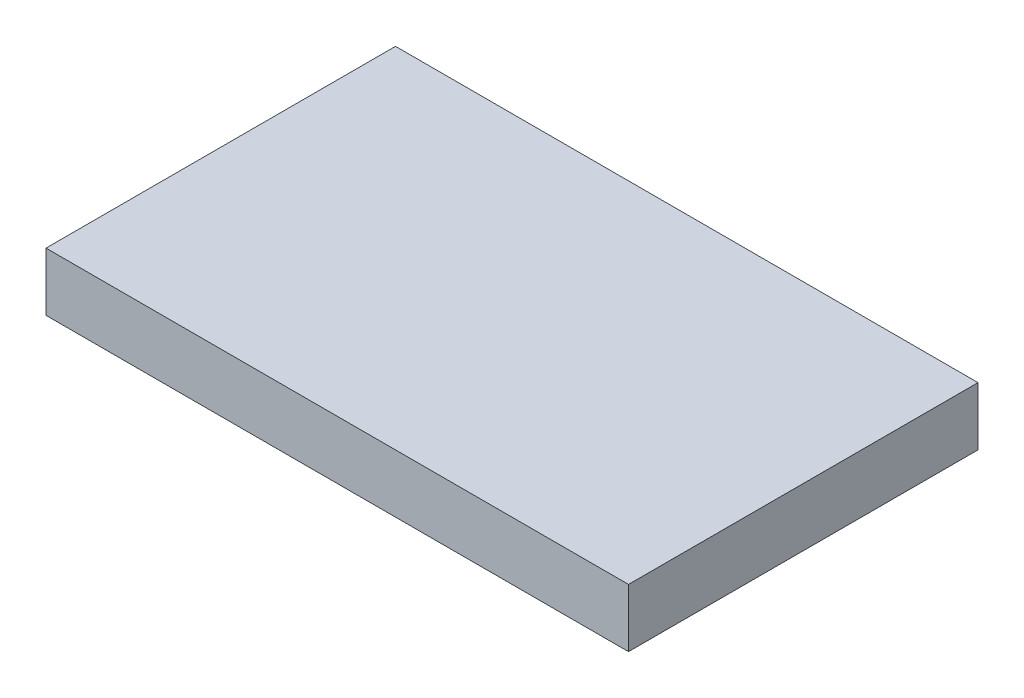
ISO-10303-21;
HEADER;
FILE_DESCRIPTION(('STEP AP214'),'2;1');
FILE_NAME('part.step','',(''),(''),'','','');
FILE_SCHEMA(('AUTOMOTIVE_DESIGN { 1 0 10303 214 1 1 1 1 }'));
ENDSEC;
DATA;
#1=APPLICATION_CONTEXT('core data for automotive mechanical design processes');
#2=APPLICATION_PROTOCOL_DEFINITION('international standard','automotive_design',2000,#1);
#3=PRODUCT_CONTEXT('',#1,'mechanical');
#4=PRODUCT('Part','Part','',(#3));
#5=PRODUCT_RELATED_PRODUCT_CATEGORY('part','',(#4));
#6=PRODUCT_DEFINITION_FORMATION('','',#4);
#7=PRODUCT_DEFINITION_CONTEXT('part definition',#1,'design');
#8=PRODUCT_DEFINITION('design','',#6,#7);
#9=PRODUCT_DEFINITION_SHAPE('','',#8);
#10=(LENGTH_UNIT() NAMED_UNIT(*) SI_UNIT(.MILLI.,.METRE.));
#11=(NAMED_UNIT(*) PLANE_ANGLE_UNIT() SI_UNIT($,.RADIAN.));
#12=(NAMED_UNIT(*) SI_UNIT($,.STERADIAN.) SOLID_ANGLE_UNIT());
#13=UNCERTAINTY_MEASURE_WITH_UNIT(LENGTH_MEASURE(1.E-05),#10,'distance_accuracy_value','');
#14=(GEOMETRIC_REPRESENTATION_CONTEXT(3) GLOBAL_UNCERTAINTY_ASSIGNED_CONTEXT((#13)) GLOBAL_UNIT_ASSIGNED_CONTEXT((#10,
#11,#12)) REPRESENTATION_CONTEXT('',''));
#15=CARTESIAN_POINT('',(0.,0.,0.));
#16=DIRECTION('',(0.,0.,1.));
#17=DIRECTION('',(1.,0.,0.));
#18=AXIS2_PLACEMENT_3D('',#15,#16,#17);
#19=CARTESIAN_POINT('',(0.,4.7625,0.));
#20=DIRECTION('',(1.,0.,0.));
#21=DIRECTION('',(0.,0.,-1.));
#22=AXIS2_PLACEMENT_3D('',#19,#20,#21);
#23=PLANE('',#22);
#24=DIRECTION('',(0.,0.,1.));
#25=VECTOR('',#24,1.);
#26=CARTESIAN_POINT('',(0.,0.,0.));
#27=LINE('',#26,#25);
#28=CARTESIAN_POINT('',(0.,0.,0.));
#29=VERTEX_POINT('',#28);
#30=CARTESIAN_POINT('',(0.,0.,28.575));
#31=VERTEX_POINT('',#30);
#32=EDGE_CURVE('E106',#29,#31,#27,.T.);
#33=ORIENTED_EDGE('',*,*,#32,.T.);
#34=DIRECTION('',(0.,-1.,0.));
#35=VECTOR('',#34,1.);
#36=CARTESIAN_POINT('',(0.,4.7625,28.575));
#37=LINE('',#36,#35);
#38=CARTESIAN_POINT('',(0.,4.7625,28.575));
#39=VERTEX_POINT('',#38);
#40=EDGE_CURVE('E11',#39,#31,#37,.T.);
#41=ORIENTED_EDGE('',*,*,#40,.F.);
#42=DIRECTION('',(0.,0.,1.));
#43=VECTOR('',#42,1.);
#44=CARTESIAN_POINT('',(0.,4.7625,0.));
#45=LINE('',#44,#43);
#46=CARTESIAN_POINT('',(0.,4.7625,0.));
#47=VERTEX_POINT('',#46);
#48=EDGE_CURVE('E94',#47,#39,#45,.T.);
#49=ORIENTED_EDGE('',*,*,#48,.F.);
#50=DIRECTION('',(0.,-1.,0.));
#51=VECTOR('',#50,1.);
#52=CARTESIAN_POINT('',(0.,4.7625,0.));
#53=LINE('',#52,#51);
#54=EDGE_CURVE('E102',#47,#29,#53,.T.);
#55=ORIENTED_EDGE('',*,*,#54,.T.);
#56=EDGE_LOOP('',(#33,#41,#49,#55));
#57=FACE_BOUND('',#56,.T.);
#58=ADVANCED_FACE('F43',(#57),#23,.F.);
#59=CARTESIAN_POINT('',(0.,4.7625,28.575));
#60=DIRECTION('',(0.,0.,-1.));
#61=DIRECTION('',(-1.,0.,0.));
#62=AXIS2_PLACEMENT_3D('',#59,#60,#61);
#63=PLANE('',#62);
#64=DIRECTION('',(1.,0.,0.));
#65=VECTOR('',#64,1.);
#66=CARTESIAN_POINT('',(0.,0.,28.575));
#67=LINE('',#66,#65);
#68=CARTESIAN_POINT('',(47.625,0.,28.575));
#69=VERTEX_POINT('',#68);
#70=EDGE_CURVE('E98',#31,#69,#67,.T.);
#71=ORIENTED_EDGE('',*,*,#70,.T.);
#72=DIRECTION('',(0.,-1.,0.));
#73=VECTOR('',#72,1.);
#74=CARTESIAN_POINT('',(47.625,4.7625,28.575));
#75=LINE('',#74,#73);
#76=CARTESIAN_POINT('',(47.625,4.7625,28.575));
#77=VERTEX_POINT('',#76);
#78=EDGE_CURVE('E51',#77,#69,#75,.T.);
#79=ORIENTED_EDGE('',*,*,#78,.F.);
#80=DIRECTION('',(1.,0.,0.));
#81=VECTOR('',#80,1.);
#82=CARTESIAN_POINT('',(0.,4.7625,28.575));
#83=LINE('',#82,#81);
#84=EDGE_CURVE('E89',#39,#77,#83,.T.);
#85=ORIENTED_EDGE('',*,*,#84,.F.);
#86=ORIENTED_EDGE('',*,*,#40,.T.);
#87=EDGE_LOOP('',(#71,#79,#85,#86));
#88=FACE_BOUND('',#87,.T.);
#89=ADVANCED_FACE('F97',(#88),#63,.F.);
#90=CARTESIAN_POINT('',(47.625,4.7625,0.));
#91=DIRECTION('',(-1.,0.,0.));
#92=DIRECTION('',(0.,0.,1.));
#93=AXIS2_PLACEMENT_3D('',#90,#91,#92);
#94=PLANE('',#93);
#95=DIRECTION('',(0.,0.,-1.));
#96=VECTOR('',#95,1.);
#97=CARTESIAN_POINT('',(47.625,0.,0.));
#98=LINE('',#97,#96);
#99=CARTESIAN_POINT('',(47.625,0.,0.));
#100=VERTEX_POINT('',#99);
#101=EDGE_CURVE('E76',#69,#100,#98,.T.);
#102=ORIENTED_EDGE('',*,*,#101,.T.);
#103=DIRECTION('',(0.,-1.,0.));
#104=VECTOR('',#103,1.);
#105=CARTESIAN_POINT('',(47.625,4.7625,0.));
#106=LINE('',#105,#104);
#107=CARTESIAN_POINT('',(47.625,4.7625,0.));
#108=VERTEX_POINT('',#107);
#109=EDGE_CURVE('E99',#108,#100,#106,.T.);
#110=ORIENTED_EDGE('',*,*,#109,.F.);
#111=DIRECTION('',(0.,0.,-1.));
#112=VECTOR('',#111,1.);
#113=CARTESIAN_POINT('',(47.625,4.7625,0.));
#114=LINE('',#113,#112);
#115=EDGE_CURVE('E92',#77,#108,#114,.T.);
#116=ORIENTED_EDGE('',*,*,#115,.F.);
#117=ORIENTED_EDGE('',*,*,#78,.T.);
#118=EDGE_LOOP('',(#102,#110,#116,#117));
#119=FACE_BOUND('',#118,.T.);
#120=ADVANCED_FACE('F100',(#119),#94,.F.);
#121=CARTESIAN_POINT('',(0.,4.7625,0.));
#122=DIRECTION('',(0.,0.,1.));
#123=DIRECTION('',(1.,0.,0.));
#124=AXIS2_PLACEMENT_3D('',#121,#122,#123);
#125=PLANE('',#124);
#126=DIRECTION('',(-1.,0.,0.));
#127=VECTOR('',#126,1.);
#128=CARTESIAN_POINT('',(0.,0.,0.));
#129=LINE('',#128,#127);
#130=EDGE_CURVE('E82',#100,#29,#129,.T.);
#131=ORIENTED_EDGE('',*,*,#130,.T.);
#132=ORIENTED_EDGE('',*,*,#54,.F.);
#133=DIRECTION('',(-1.,0.,0.));
#134=VECTOR('',#133,1.);
#135=CARTESIAN_POINT('',(0.,4.7625,0.));
#136=LINE('',#135,#134);
#137=EDGE_CURVE('E59',#108,#47,#136,.T.);
#138=ORIENTED_EDGE('',*,*,#137,.F.);
#139=ORIENTED_EDGE('',*,*,#109,.T.);
#140=EDGE_LOOP('',(#131,#132,#138,#139));
#141=FACE_BOUND('',#140,.T.);
#142=ADVANCED_FACE('F113',(#141),#125,.F.);
#143=CARTESIAN_POINT('',(0.,4.7625,0.));
#144=DIRECTION('',(0.,1.,0.));
#145=DIRECTION('',(0.,0.,1.));
#146=AXIS2_PLACEMENT_3D('',#143,#144,#145);
#147=PLANE('',#146);
#148=ORIENTED_EDGE('',*,*,#48,.T.);
#149=ORIENTED_EDGE('',*,*,#84,.T.);
#150=ORIENTED_EDGE('',*,*,#115,.T.);
#151=ORIENTED_EDGE('',*,*,#137,.T.);
#152=EDGE_LOOP('',(#148,#149,#150,#151));
#153=FACE_BOUND('',#152,.T.);
#154=ADVANCED_FACE('F90',(#153),#147,.T.);
#155=CARTESIAN_POINT('',(0.,0.,0.));
#156=DIRECTION('',(0.,1.,0.));
#157=DIRECTION('',(0.,0.,1.));
#158=AXIS2_PLACEMENT_3D('',#155,#156,#157);
#159=PLANE('',#158);
#160=ORIENTED_EDGE('',*,*,#32,.F.);
#161=ORIENTED_EDGE('',*,*,#130,.F.);
#162=ORIENTED_EDGE('',*,*,#101,.F.);
#163=ORIENTED_EDGE('',*,*,#70,.F.);
#164=EDGE_LOOP('',(#160,#161,#162,#163));
#165=FACE_BOUND('',#164,.T.);
#166=ADVANCED_FACE('F116',(#165),#159,.F.);
#167=CLOSED_SHELL('',(#58,#89,#120,#142,#154,#166));
#168=MANIFOLD_SOLID_BREP('B2',#167);
#169=ADVANCED_BREP_SHAPE_REPRESENTATION('',(#18,#168),#14);
#170=SHAPE_DEFINITION_REPRESENTATION(#9,#169);
ENDSEC;
END-ISO-10303-21;
